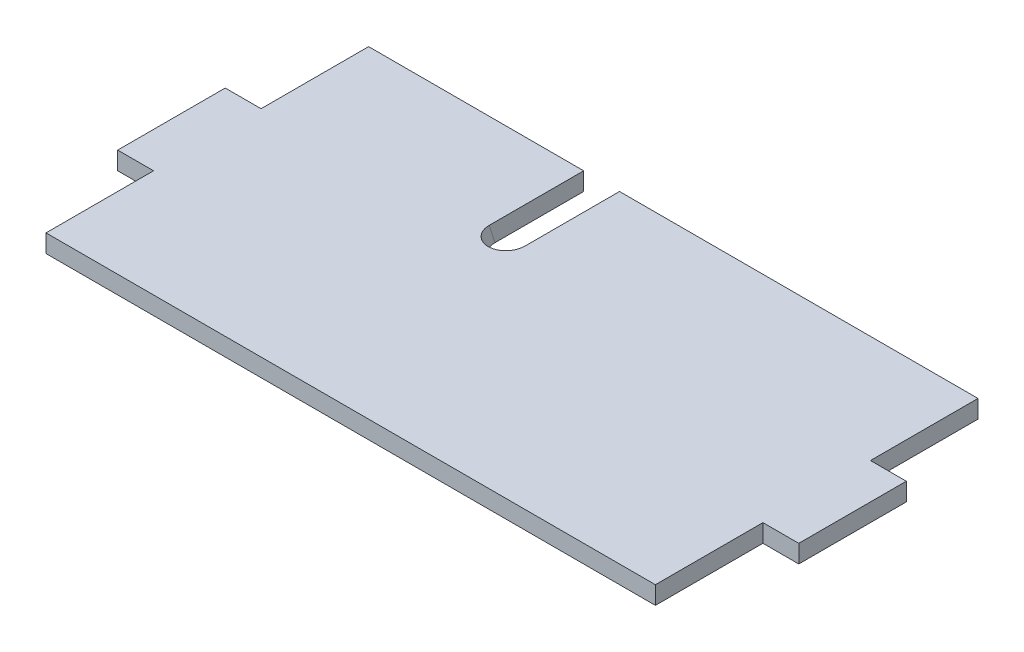
ISO-10303-21;
HEADER;
FILE_DESCRIPTION(('STEP AP214'),'2;1');
FILE_NAME('part.step','',(''),(''),'','','');
FILE_SCHEMA(('AUTOMOTIVE_DESIGN { 1 0 10303 214 1 1 1 1 }'));
ENDSEC;
DATA;
#1=APPLICATION_CONTEXT('core data for automotive mechanical design processes');
#2=APPLICATION_PROTOCOL_DEFINITION('international standard','automotive_design',2000,#1);
#3=PRODUCT_CONTEXT('',#1,'mechanical');
#4=PRODUCT('Part','Part','',(#3));
#5=PRODUCT_RELATED_PRODUCT_CATEGORY('part','',(#4));
#6=PRODUCT_DEFINITION_FORMATION('','',#4);
#7=PRODUCT_DEFINITION_CONTEXT('part definition',#1,'design');
#8=PRODUCT_DEFINITION('design','',#6,#7);
#9=PRODUCT_DEFINITION_SHAPE('','',#8);
#10=(LENGTH_UNIT() NAMED_UNIT(*) SI_UNIT(.MILLI.,.METRE.));
#11=(NAMED_UNIT(*) PLANE_ANGLE_UNIT() SI_UNIT($,.RADIAN.));
#12=(NAMED_UNIT(*) SI_UNIT($,.STERADIAN.) SOLID_ANGLE_UNIT());
#13=UNCERTAINTY_MEASURE_WITH_UNIT(LENGTH_MEASURE(1.E-05),#10,'distance_accuracy_value','');
#14=(GEOMETRIC_REPRESENTATION_CONTEXT(3) GLOBAL_UNCERTAINTY_ASSIGNED_CONTEXT((#13)) GLOBAL_UNIT_ASSIGNED_CONTEXT((#10,
#11,#12)) REPRESENTATION_CONTEXT('',''));
#15=CARTESIAN_POINT('',(0.,0.,0.));
#16=DIRECTION('',(0.,0.,1.));
#17=DIRECTION('',(1.,0.,0.));
#18=AXIS2_PLACEMENT_3D('',#15,#16,#17);
#19=CARTESIAN_POINT('',(-215.9,6.35,-88.9));
#20=DIRECTION('',(0.,0.,1.));
#21=DIRECTION('',(1.,0.,0.));
#22=AXIS2_PLACEMENT_3D('',#19,#20,#21);
#23=PLANE('',#22);
#24=DIRECTION('',(-1.,0.,0.));
#25=VECTOR('',#24,1.);
#26=CARTESIAN_POINT('',(-215.9,6.35,-88.9));
#27=LINE('',#26,#25);
#28=CARTESIAN_POINT('',(-63.5000000000009,6.34999999999999,-88.9));
#29=VERTEX_POINT('',#28);
#30=CARTESIAN_POINT('',(-215.9,6.35,-88.9));
#31=VERTEX_POINT('',#30);
#32=EDGE_CURVE('E306',#29,#31,#27,.T.);
#33=ORIENTED_EDGE('',*,*,#32,.F.);
#34=DIRECTION('',(0.,1.,0.));
#35=VECTOR('',#34,1.);
#36=CARTESIAN_POINT('',(-63.5000000000009,6.34999999999999,-88.9));
#37=LINE('',#36,#35);
#38=CARTESIAN_POINT('',(-63.5000000000009,-6.34999999999999,-88.9));
#39=VERTEX_POINT('',#38);
#40=EDGE_CURVE('E194',#39,#29,#37,.T.);
#41=ORIENTED_EDGE('',*,*,#40,.F.);
#42=DIRECTION('',(-1.,0.,0.));
#43=VECTOR('',#42,1.);
#44=CARTESIAN_POINT('',(-215.9,-6.35,-88.9));
#45=LINE('',#44,#43);
#46=CARTESIAN_POINT('',(-215.9,-6.35,-88.9));
#47=VERTEX_POINT('',#46);
#48=EDGE_CURVE('E201',#39,#47,#45,.T.);
#49=ORIENTED_EDGE('',*,*,#48,.T.);
#50=DIRECTION('',(0.,-1.,0.));
#51=VECTOR('',#50,1.);
#52=CARTESIAN_POINT('',(-215.9,6.35,-88.9));
#53=LINE('',#52,#51);
#54=EDGE_CURVE('E274',#31,#47,#53,.T.);
#55=ORIENTED_EDGE('',*,*,#54,.F.);
#56=EDGE_LOOP('',(#33,#41,#49,#55));
#57=FACE_BOUND('',#56,.T.);
#58=ADVANCED_FACE('F43',(#57),#23,.F.);
#59=CARTESIAN_POINT('',(-50.7999999999984,-226.171808135511,-98.2610939856412));
#60=DIRECTION('',(0.,0.950122861158082,0.31187585463575));
#61=DIRECTION('',(0.,0.31187585463575,-0.950122861158083));
#62=AXIS2_PLACEMENT_3D('',#59,#60,#61);
#63=CYLINDRICAL_SURFACE('',#62,12.7000000000001);
#64=CARTESIAN_POINT('',(-50.7999999999983,-6.34999999999999,-26.1050422974673));
#65=DIRECTION('',(0.,1.,0.));
#66=DIRECTION('',(0.,0.,1.));
#67=AXIS2_PLACEMENT_3D('',#64,#65,#66);
#68=ELLIPSE('',#67,13.3666923712586,12.7000000000001);
#69=CARTESIAN_POINT('',(-38.0999999999989,-6.34999999999999,-26.1050422974674));
#70=VERTEX_POINT('',#69);
#71=CARTESIAN_POINT('',(-63.4999999999984,-6.34999999999999,-26.1050422974673));
#72=VERTEX_POINT('',#71);
#73=EDGE_CURVE('E11',#70,#72,#68,.F.);
#74=ORIENTED_EDGE('',*,*,#73,.T.);
#75=DIRECTION('',(0.,0.950122861158082,0.31187585463575));
#76=VECTOR('',#75,1.);
#77=CARTESIAN_POINT('',(-63.4999999999997,-226.171808135511,-98.2610939856412));
#78=LINE('',#77,#76);
#79=CARTESIAN_POINT('',(-63.4999999999996,6.34999999999999,-21.936293690528));
#80=VERTEX_POINT('',#79);
#81=EDGE_CURVE('E184',#80,#72,#78,.F.);
#82=ORIENTED_EDGE('',*,*,#81,.F.);
#83=CARTESIAN_POINT('',(-50.7999999999983,6.34999999999999,-21.936293690528));
#84=DIRECTION('',(0.,1.,0.));
#85=DIRECTION('',(0.,0.,1.));
#86=AXIS2_PLACEMENT_3D('',#83,#84,#85);
#87=ELLIPSE('',#86,13.3666923712586,12.7000000000001);
#88=CARTESIAN_POINT('',(-38.0999999999982,6.34999999999999,-21.936293690528));
#89=VERTEX_POINT('',#88);
#90=EDGE_CURVE('E47',#89,#80,#87,.F.);
#91=ORIENTED_EDGE('',*,*,#90,.F.);
#92=DIRECTION('',(0.,0.950122861158082,0.31187585463575));
#93=VECTOR('',#92,1.);
#94=CARTESIAN_POINT('',(-38.0999999999989,-226.171808135511,-98.2610939856412));
#95=LINE('',#94,#93);
#96=EDGE_CURVE('E203',#89,#70,#95,.F.);
#97=ORIENTED_EDGE('',*,*,#96,.T.);
#98=EDGE_LOOP('',(#74,#82,#91,#97));
#99=FACE_BOUND('',#98,.T.);
#100=ADVANCED_FACE('F205',(#99),#63,.F.);
#101=CARTESIAN_POINT('',(-215.9,6.35,-88.9));
#102=DIRECTION('',(1.,0.,0.));
#103=DIRECTION('',(0.,0.,-1.));
#104=AXIS2_PLACEMENT_3D('',#101,#102,#103);
#105=PLANE('',#104);
#106=DIRECTION('',(0.,0.,1.));
#107=VECTOR('',#106,1.);
#108=CARTESIAN_POINT('',(-215.9,-6.35,-88.9));
#109=LINE('',#108,#107);
#110=CARTESIAN_POINT('',(-215.9,-6.35,-12.7));
#111=VERTEX_POINT('',#110);
#112=EDGE_CURVE('E193',#47,#111,#109,.T.);
#113=ORIENTED_EDGE('',*,*,#112,.T.);
#114=DIRECTION('',(0.,-1.,0.));
#115=VECTOR('',#114,1.);
#116=CARTESIAN_POINT('',(-215.9,6.35,-12.7));
#117=LINE('',#116,#115);
#118=CARTESIAN_POINT('',(-215.9,6.35,-12.7));
#119=VERTEX_POINT('',#118);
#120=EDGE_CURVE('E220',#119,#111,#117,.T.);
#121=ORIENTED_EDGE('',*,*,#120,.F.);
#122=DIRECTION('',(0.,0.,1.));
#123=VECTOR('',#122,1.);
#124=CARTESIAN_POINT('',(-215.9,6.35,-88.9));
#125=LINE('',#124,#123);
#126=EDGE_CURVE('E336',#31,#119,#125,.T.);
#127=ORIENTED_EDGE('',*,*,#126,.F.);
#128=ORIENTED_EDGE('',*,*,#54,.T.);
#129=EDGE_LOOP('',(#113,#121,#127,#128));
#130=FACE_BOUND('',#129,.T.);
#131=ADVANCED_FACE('F357',(#130),#105,.F.);
#132=CARTESIAN_POINT('',(-241.3,6.35,-12.7));
#133=DIRECTION('',(0.,0.,1.));
#134=DIRECTION('',(1.,0.,0.));
#135=AXIS2_PLACEMENT_3D('',#132,#133,#134);
#136=PLANE('',#135);
#137=DIRECTION('',(-1.,0.,0.));
#138=VECTOR('',#137,1.);
#139=CARTESIAN_POINT('',(-241.3,-6.35,-12.7));
#140=LINE('',#139,#138);
#141=CARTESIAN_POINT('',(-241.3,-6.35,-12.7));
#142=VERTEX_POINT('',#141);
#143=EDGE_CURVE('E225',#111,#142,#140,.T.);
#144=ORIENTED_EDGE('',*,*,#143,.T.);
#145=DIRECTION('',(0.,-1.,0.));
#146=VECTOR('',#145,1.);
#147=CARTESIAN_POINT('',(-241.3,6.35,-12.7));
#148=LINE('',#147,#146);
#149=CARTESIAN_POINT('',(-241.3,6.35,-12.7));
#150=VERTEX_POINT('',#149);
#151=EDGE_CURVE('E226',#150,#142,#148,.T.);
#152=ORIENTED_EDGE('',*,*,#151,.F.);
#153=DIRECTION('',(-1.,0.,0.));
#154=VECTOR('',#153,1.);
#155=CARTESIAN_POINT('',(-241.3,6.35,-12.7));
#156=LINE('',#155,#154);
#157=EDGE_CURVE('E334',#119,#150,#156,.T.);
#158=ORIENTED_EDGE('',*,*,#157,.F.);
#159=ORIENTED_EDGE('',*,*,#120,.T.);
#160=EDGE_LOOP('',(#144,#152,#158,#159));
#161=FACE_BOUND('',#160,.T.);
#162=ADVANCED_FACE('F359',(#161),#136,.F.);
#163=CARTESIAN_POINT('',(-241.3,6.35,-12.7));
#164=DIRECTION('',(1.,0.,0.));
#165=DIRECTION('',(0.,0.,-1.));
#166=AXIS2_PLACEMENT_3D('',#163,#164,#165);
#167=PLANE('',#166);
#168=DIRECTION('',(0.,0.,1.));
#169=VECTOR('',#168,1.);
#170=CARTESIAN_POINT('',(-241.3,-6.35,-12.7));
#171=LINE('',#170,#169);
#172=CARTESIAN_POINT('',(-241.3,-6.35,63.5));
#173=VERTEX_POINT('',#172);
#174=EDGE_CURVE('E224',#142,#173,#171,.T.);
#175=ORIENTED_EDGE('',*,*,#174,.T.);
#176=DIRECTION('',(0.,-1.,0.));
#177=VECTOR('',#176,1.);
#178=CARTESIAN_POINT('',(-241.3,6.35,63.5));
#179=LINE('',#178,#177);
#180=CARTESIAN_POINT('',(-241.3,6.35,63.5));
#181=VERTEX_POINT('',#180);
#182=EDGE_CURVE('E230',#181,#173,#179,.T.);
#183=ORIENTED_EDGE('',*,*,#182,.F.);
#184=DIRECTION('',(0.,0.,1.));
#185=VECTOR('',#184,1.);
#186=CARTESIAN_POINT('',(-241.3,6.35,-12.7));
#187=LINE('',#186,#185);
#188=EDGE_CURVE('E331',#150,#181,#187,.T.);
#189=ORIENTED_EDGE('',*,*,#188,.F.);
#190=ORIENTED_EDGE('',*,*,#151,.T.);
#191=EDGE_LOOP('',(#175,#183,#189,#190));
#192=FACE_BOUND('',#191,.T.);
#193=ADVANCED_FACE('F366',(#192),#167,.F.);
#194=CARTESIAN_POINT('',(-215.9,6.35,63.5));
#195=DIRECTION('',(0.,0.,-1.));
#196=DIRECTION('',(-1.,0.,0.));
#197=AXIS2_PLACEMENT_3D('',#194,#195,#196);
#198=PLANE('',#197);
#199=DIRECTION('',(1.,0.,0.));
#200=VECTOR('',#199,1.);
#201=CARTESIAN_POINT('',(-215.9,-6.35,63.5));
#202=LINE('',#201,#200);
#203=CARTESIAN_POINT('',(-215.9,-6.35,63.5));
#204=VERTEX_POINT('',#203);
#205=EDGE_CURVE('E229',#173,#204,#202,.T.);
#206=ORIENTED_EDGE('',*,*,#205,.T.);
#207=DIRECTION('',(0.,-1.,0.));
#208=VECTOR('',#207,1.);
#209=CARTESIAN_POINT('',(-215.9,6.35,63.5));
#210=LINE('',#209,#208);
#211=CARTESIAN_POINT('',(-215.9,6.35,63.5));
#212=VERTEX_POINT('',#211);
#213=EDGE_CURVE('E235',#212,#204,#210,.T.);
#214=ORIENTED_EDGE('',*,*,#213,.F.);
#215=DIRECTION('',(1.,0.,0.));
#216=VECTOR('',#215,1.);
#217=CARTESIAN_POINT('',(-215.9,6.35,63.5));
#218=LINE('',#217,#216);
#219=EDGE_CURVE('E328',#181,#212,#218,.T.);
#220=ORIENTED_EDGE('',*,*,#219,.F.);
#221=ORIENTED_EDGE('',*,*,#182,.T.);
#222=EDGE_LOOP('',(#206,#214,#220,#221));
#223=FACE_BOUND('',#222,.T.);
#224=ADVANCED_FACE('F370',(#223),#198,.F.);
#225=CARTESIAN_POINT('',(-215.9,6.35,63.5));
#226=DIRECTION('',(1.,0.,0.));
#227=DIRECTION('',(0.,0.,-1.));
#228=AXIS2_PLACEMENT_3D('',#225,#226,#227);
#229=PLANE('',#228);
#230=DIRECTION('',(0.,0.,1.));
#231=VECTOR('',#230,1.);
#232=CARTESIAN_POINT('',(-215.9,-6.35,63.5));
#233=LINE('',#232,#231);
#234=CARTESIAN_POINT('',(-215.9,-6.35,139.7));
#235=VERTEX_POINT('',#234);
#236=EDGE_CURVE('E234',#204,#235,#233,.T.);
#237=ORIENTED_EDGE('',*,*,#236,.T.);
#238=DIRECTION('',(0.,-1.,0.));
#239=VECTOR('',#238,1.);
#240=CARTESIAN_POINT('',(-215.9,6.35,139.7));
#241=LINE('',#240,#239);
#242=CARTESIAN_POINT('',(-215.9,6.35,139.7));
#243=VERTEX_POINT('',#242);
#244=EDGE_CURVE('E240',#243,#235,#241,.T.);
#245=ORIENTED_EDGE('',*,*,#244,.F.);
#246=DIRECTION('',(0.,0.,1.));
#247=VECTOR('',#246,1.);
#248=CARTESIAN_POINT('',(-215.9,6.35,63.5));
#249=LINE('',#248,#247);
#250=EDGE_CURVE('E325',#212,#243,#249,.T.);
#251=ORIENTED_EDGE('',*,*,#250,.F.);
#252=ORIENTED_EDGE('',*,*,#213,.T.);
#253=EDGE_LOOP('',(#237,#245,#251,#252));
#254=FACE_BOUND('',#253,.T.);
#255=ADVANCED_FACE('F375',(#254),#229,.F.);
#256=CARTESIAN_POINT('',(-215.9,6.35,139.7));
#257=DIRECTION('',(0.,0.,-1.));
#258=DIRECTION('',(-1.,0.,0.));
#259=AXIS2_PLACEMENT_3D('',#256,#257,#258);
#260=PLANE('',#259);
#261=DIRECTION('',(1.,0.,0.));
#262=VECTOR('',#261,1.);
#263=CARTESIAN_POINT('',(-215.9,-6.35,139.7));
#264=LINE('',#263,#262);
#265=CARTESIAN_POINT('',(215.9,-6.35,139.7));
#266=VERTEX_POINT('',#265);
#267=EDGE_CURVE('E239',#235,#266,#264,.T.);
#268=ORIENTED_EDGE('',*,*,#267,.T.);
#269=DIRECTION('',(0.,-1.,0.));
#270=VECTOR('',#269,1.);
#271=CARTESIAN_POINT('',(215.9,6.35,139.7));
#272=LINE('',#271,#270);
#273=CARTESIAN_POINT('',(215.9,6.35,139.7));
#274=VERTEX_POINT('',#273);
#275=EDGE_CURVE('E245',#274,#266,#272,.T.);
#276=ORIENTED_EDGE('',*,*,#275,.F.);
#277=DIRECTION('',(1.,0.,0.));
#278=VECTOR('',#277,1.);
#279=CARTESIAN_POINT('',(-215.9,6.35,139.7));
#280=LINE('',#279,#278);
#281=EDGE_CURVE('E322',#243,#274,#280,.T.);
#282=ORIENTED_EDGE('',*,*,#281,.F.);
#283=ORIENTED_EDGE('',*,*,#244,.T.);
#284=EDGE_LOOP('',(#268,#276,#282,#283));
#285=FACE_BOUND('',#284,.T.);
#286=ADVANCED_FACE('F381',(#285),#260,.F.);
#287=CARTESIAN_POINT('',(215.9,6.35,63.5));
#288=DIRECTION('',(-1.,0.,0.));
#289=DIRECTION('',(0.,0.,1.));
#290=AXIS2_PLACEMENT_3D('',#287,#288,#289);
#291=PLANE('',#290);
#292=DIRECTION('',(0.,0.,-1.));
#293=VECTOR('',#292,1.);
#294=CARTESIAN_POINT('',(215.9,-6.35,63.5));
#295=LINE('',#294,#293);
#296=CARTESIAN_POINT('',(215.9,-6.35,63.5));
#297=VERTEX_POINT('',#296);
#298=EDGE_CURVE('E244',#266,#297,#295,.T.);
#299=ORIENTED_EDGE('',*,*,#298,.T.);
#300=DIRECTION('',(0.,-1.,0.));
#301=VECTOR('',#300,1.);
#302=CARTESIAN_POINT('',(215.9,6.35,63.5));
#303=LINE('',#302,#301);
#304=CARTESIAN_POINT('',(215.9,6.35,63.5));
#305=VERTEX_POINT('',#304);
#306=EDGE_CURVE('E250',#305,#297,#303,.T.);
#307=ORIENTED_EDGE('',*,*,#306,.F.);
#308=DIRECTION('',(0.,0.,-1.));
#309=VECTOR('',#308,1.);
#310=CARTESIAN_POINT('',(215.9,6.35,63.5));
#311=LINE('',#310,#309);
#312=EDGE_CURVE('E319',#274,#305,#311,.T.);
#313=ORIENTED_EDGE('',*,*,#312,.F.);
#314=ORIENTED_EDGE('',*,*,#275,.T.);
#315=EDGE_LOOP('',(#299,#307,#313,#314));
#316=FACE_BOUND('',#315,.T.);
#317=ADVANCED_FACE('F385',(#316),#291,.F.);
#318=CARTESIAN_POINT('',(215.9,6.35,63.5));
#319=DIRECTION('',(0.,0.,-1.));
#320=DIRECTION('',(-1.,0.,0.));
#321=AXIS2_PLACEMENT_3D('',#318,#319,#320);
#322=PLANE('',#321);
#323=DIRECTION('',(1.,0.,0.));
#324=VECTOR('',#323,1.);
#325=CARTESIAN_POINT('',(215.9,-6.35,63.5));
#326=LINE('',#325,#324);
#327=CARTESIAN_POINT('',(241.3,-6.35,63.5));
#328=VERTEX_POINT('',#327);
#329=EDGE_CURVE('E249',#297,#328,#326,.T.);
#330=ORIENTED_EDGE('',*,*,#329,.T.);
#331=DIRECTION('',(0.,-1.,0.));
#332=VECTOR('',#331,1.);
#333=CARTESIAN_POINT('',(241.3,6.35,63.5));
#334=LINE('',#333,#332);
#335=CARTESIAN_POINT('',(241.3,6.35,63.5));
#336=VERTEX_POINT('',#335);
#337=EDGE_CURVE('E255',#336,#328,#334,.T.);
#338=ORIENTED_EDGE('',*,*,#337,.F.);
#339=DIRECTION('',(1.,0.,0.));
#340=VECTOR('',#339,1.);
#341=CARTESIAN_POINT('',(215.9,6.35,63.5));
#342=LINE('',#341,#340);
#343=EDGE_CURVE('E316',#305,#336,#342,.T.);
#344=ORIENTED_EDGE('',*,*,#343,.F.);
#345=ORIENTED_EDGE('',*,*,#306,.T.);
#346=EDGE_LOOP('',(#330,#338,#344,#345));
#347=FACE_BOUND('',#346,.T.);
#348=ADVANCED_FACE('F390',(#347),#322,.F.);
#349=CARTESIAN_POINT('',(241.3,6.35,-12.7));
#350=DIRECTION('',(-1.,0.,0.));
#351=DIRECTION('',(0.,0.,1.));
#352=AXIS2_PLACEMENT_3D('',#349,#350,#351);
#353=PLANE('',#352);
#354=DIRECTION('',(0.,0.,-1.));
#355=VECTOR('',#354,1.);
#356=CARTESIAN_POINT('',(241.3,-6.35,-12.7));
#357=LINE('',#356,#355);
#358=CARTESIAN_POINT('',(241.3,-6.35,-12.7));
#359=VERTEX_POINT('',#358);
#360=EDGE_CURVE('E254',#328,#359,#357,.T.);
#361=ORIENTED_EDGE('',*,*,#360,.T.);
#362=DIRECTION('',(0.,-1.,0.));
#363=VECTOR('',#362,1.);
#364=CARTESIAN_POINT('',(241.3,6.35,-12.7));
#365=LINE('',#364,#363);
#366=CARTESIAN_POINT('',(241.3,6.35,-12.7));
#367=VERTEX_POINT('',#366);
#368=EDGE_CURVE('E260',#367,#359,#365,.T.);
#369=ORIENTED_EDGE('',*,*,#368,.F.);
#370=DIRECTION('',(0.,0.,-1.));
#371=VECTOR('',#370,1.);
#372=CARTESIAN_POINT('',(241.3,6.35,-12.7));
#373=LINE('',#372,#371);
#374=EDGE_CURVE('E313',#336,#367,#373,.T.);
#375=ORIENTED_EDGE('',*,*,#374,.F.);
#376=ORIENTED_EDGE('',*,*,#337,.T.);
#377=EDGE_LOOP('',(#361,#369,#375,#376));
#378=FACE_BOUND('',#377,.T.);
#379=ADVANCED_FACE('F396',(#378),#353,.F.);
#380=CARTESIAN_POINT('',(241.3,6.35,-12.7));
#381=DIRECTION('',(0.,0.,1.));
#382=DIRECTION('',(1.,0.,0.));
#383=AXIS2_PLACEMENT_3D('',#380,#381,#382);
#384=PLANE('',#383);
#385=DIRECTION('',(-1.,0.,0.));
#386=VECTOR('',#385,1.);
#387=CARTESIAN_POINT('',(241.3,-6.35,-12.7));
#388=LINE('',#387,#386);
#389=CARTESIAN_POINT('',(215.9,-6.35,-12.7));
#390=VERTEX_POINT('',#389);
#391=EDGE_CURVE('E259',#359,#390,#388,.T.);
#392=ORIENTED_EDGE('',*,*,#391,.T.);
#393=DIRECTION('',(0.,-1.,0.));
#394=VECTOR('',#393,1.);
#395=CARTESIAN_POINT('',(215.9,6.35,-12.7));
#396=LINE('',#395,#394);
#397=CARTESIAN_POINT('',(215.9,6.35,-12.7));
#398=VERTEX_POINT('',#397);
#399=EDGE_CURVE('E265',#398,#390,#396,.T.);
#400=ORIENTED_EDGE('',*,*,#399,.F.);
#401=DIRECTION('',(-1.,0.,0.));
#402=VECTOR('',#401,1.);
#403=CARTESIAN_POINT('',(241.3,6.35,-12.7));
#404=LINE('',#403,#402);
#405=EDGE_CURVE('E310',#367,#398,#404,.T.);
#406=ORIENTED_EDGE('',*,*,#405,.F.);
#407=ORIENTED_EDGE('',*,*,#368,.T.);
#408=EDGE_LOOP('',(#392,#400,#406,#407));
#409=FACE_BOUND('',#408,.T.);
#410=ADVANCED_FACE('F400',(#409),#384,.F.);
#411=CARTESIAN_POINT('',(215.9,6.35,-88.9));
#412=DIRECTION('',(-1.,0.,0.));
#413=DIRECTION('',(0.,0.,1.));
#414=AXIS2_PLACEMENT_3D('',#411,#412,#413);
#415=PLANE('',#414);
#416=DIRECTION('',(0.,0.,-1.));
#417=VECTOR('',#416,1.);
#418=CARTESIAN_POINT('',(215.9,-6.35,-88.9));
#419=LINE('',#418,#417);
#420=CARTESIAN_POINT('',(215.9,-6.35,-88.9));
#421=VERTEX_POINT('',#420);
#422=EDGE_CURVE('E264',#390,#421,#419,.T.);
#423=ORIENTED_EDGE('',*,*,#422,.T.);
#424=DIRECTION('',(0.,-1.,0.));
#425=VECTOR('',#424,1.);
#426=CARTESIAN_POINT('',(215.9,6.35,-88.9));
#427=LINE('',#426,#425);
#428=CARTESIAN_POINT('',(215.9,6.35,-88.9));
#429=VERTEX_POINT('',#428);
#430=EDGE_CURVE('E269',#429,#421,#427,.T.);
#431=ORIENTED_EDGE('',*,*,#430,.F.);
#432=DIRECTION('',(0.,0.,-1.));
#433=VECTOR('',#432,1.);
#434=CARTESIAN_POINT('',(215.9,6.35,-88.9));
#435=LINE('',#434,#433);
#436=EDGE_CURVE('E307',#398,#429,#435,.T.);
#437=ORIENTED_EDGE('',*,*,#436,.F.);
#438=ORIENTED_EDGE('',*,*,#399,.T.);
#439=EDGE_LOOP('',(#423,#431,#437,#438));
#440=FACE_BOUND('',#439,.T.);
#441=ADVANCED_FACE('F405',(#440),#415,.F.);
#442=CARTESIAN_POINT('',(-38.1000000000006,-6.35,-88.9));
#443=VERTEX_POINT('',#442);
#444=EDGE_CURVE('E273',#421,#443,#45,.T.);
#445=ORIENTED_EDGE('',*,*,#444,.T.);
#446=DIRECTION('',(0.,-1.,0.));
#447=VECTOR('',#446,1.);
#448=CARTESIAN_POINT('',(-38.1000000000006,-6.35,-88.9));
#449=LINE('',#448,#447);
#450=CARTESIAN_POINT('',(-38.1000000000007,6.34999999999999,-88.9));
#451=VERTEX_POINT('',#450);
#452=EDGE_CURVE('E211',#451,#443,#449,.T.);
#453=ORIENTED_EDGE('',*,*,#452,.F.);
#454=EDGE_CURVE('E53',#429,#451,#27,.T.);
#455=ORIENTED_EDGE('',*,*,#454,.F.);
#456=ORIENTED_EDGE('',*,*,#430,.T.);
#457=EDGE_LOOP('',(#445,#453,#455,#456));
#458=FACE_BOUND('',#457,.T.);
#459=ADVANCED_FACE('F347',(#458),#23,.F.);
#460=CARTESIAN_POINT('',(0.,6.35,0.));
#461=DIRECTION('',(0.,1.,0.));
#462=DIRECTION('',(0.,0.,1.));
#463=AXIS2_PLACEMENT_3D('',#460,#461,#462);
#464=PLANE('',#463);
#465=DIRECTION('',(0.,0.,-1.));
#466=VECTOR('',#465,1.);
#467=CARTESIAN_POINT('',(-63.5000000000009,6.34999999999999,139.701));
#468=LINE('',#467,#466);
#469=EDGE_CURVE('E75',#80,#29,#468,.T.);
#470=ORIENTED_EDGE('',*,*,#469,.T.);
#471=ORIENTED_EDGE('',*,*,#32,.T.);
#472=ORIENTED_EDGE('',*,*,#126,.T.);
#473=ORIENTED_EDGE('',*,*,#157,.T.);
#474=ORIENTED_EDGE('',*,*,#188,.T.);
#475=ORIENTED_EDGE('',*,*,#219,.T.);
#476=ORIENTED_EDGE('',*,*,#250,.T.);
#477=ORIENTED_EDGE('',*,*,#281,.T.);
#478=ORIENTED_EDGE('',*,*,#312,.T.);
#479=ORIENTED_EDGE('',*,*,#343,.T.);
#480=ORIENTED_EDGE('',*,*,#374,.T.);
#481=ORIENTED_EDGE('',*,*,#405,.T.);
#482=ORIENTED_EDGE('',*,*,#436,.T.);
#483=ORIENTED_EDGE('',*,*,#454,.T.);
#484=DIRECTION('',(0.,0.,-1.));
#485=VECTOR('',#484,1.);
#486=CARTESIAN_POINT('',(-38.1000000000007,6.34999999999999,139.701));
#487=LINE('',#486,#485);
#488=EDGE_CURVE('E215',#89,#451,#487,.T.);
#489=ORIENTED_EDGE('',*,*,#488,.F.);
#490=ORIENTED_EDGE('',*,*,#90,.T.);
#491=EDGE_LOOP('',(#470,#471,#472,#473,#474,#475,#476,#477,#478,#479,#480,#481,#482,#483,#489,#490));
#492=FACE_BOUND('',#491,.T.);
#493=ADVANCED_FACE('F45',(#492),#464,.T.);
#494=CARTESIAN_POINT('',(0.,-6.35,0.));
#495=DIRECTION('',(0.,1.,0.));
#496=DIRECTION('',(0.,0.,1.));
#497=AXIS2_PLACEMENT_3D('',#494,#495,#496);
#498=PLANE('',#497);
#499=ORIENTED_EDGE('',*,*,#48,.F.);
#500=DIRECTION('',(0.,0.,-1.));
#501=VECTOR('',#500,1.);
#502=CARTESIAN_POINT('',(-63.5000000000009,-6.34999999999999,139.701));
#503=LINE('',#502,#501);
#504=EDGE_CURVE('E187',#72,#39,#503,.T.);
#505=ORIENTED_EDGE('',*,*,#504,.F.);
#506=ORIENTED_EDGE('',*,*,#73,.F.);
#507=DIRECTION('',(0.,0.,-1.));
#508=VECTOR('',#507,1.);
#509=CARTESIAN_POINT('',(-38.1000000000006,-6.35,139.701));
#510=LINE('',#509,#508);
#511=EDGE_CURVE('E64',#70,#443,#510,.T.);
#512=ORIENTED_EDGE('',*,*,#511,.T.);
#513=ORIENTED_EDGE('',*,*,#444,.F.);
#514=ORIENTED_EDGE('',*,*,#422,.F.);
#515=ORIENTED_EDGE('',*,*,#391,.F.);
#516=ORIENTED_EDGE('',*,*,#360,.F.);
#517=ORIENTED_EDGE('',*,*,#329,.F.);
#518=ORIENTED_EDGE('',*,*,#298,.F.);
#519=ORIENTED_EDGE('',*,*,#267,.F.);
#520=ORIENTED_EDGE('',*,*,#236,.F.);
#521=ORIENTED_EDGE('',*,*,#205,.F.);
#522=ORIENTED_EDGE('',*,*,#174,.F.);
#523=ORIENTED_EDGE('',*,*,#143,.F.);
#524=ORIENTED_EDGE('',*,*,#112,.F.);
#525=EDGE_LOOP('',(#499,#505,#506,#512,#513,#514,#515,#516,#517,#518,#519,#520,#521,#522,#523,#524));
#526=FACE_BOUND('',#525,.T.);
#527=ADVANCED_FACE('F199',(#526),#498,.F.);
#528=CARTESIAN_POINT('',(-38.1000000000006,-6.35,139.701));
#529=DIRECTION('',(1.,0.,0.));
#530=DIRECTION('',(0.,1.,0.));
#531=AXIS2_PLACEMENT_3D('',#528,#529,#530);
#532=PLANE('',#531);
#533=ORIENTED_EDGE('',*,*,#488,.T.);
#534=ORIENTED_EDGE('',*,*,#452,.T.);
#535=ORIENTED_EDGE('',*,*,#511,.F.);
#536=ORIENTED_EDGE('',*,*,#96,.F.);
#537=EDGE_LOOP('',(#533,#534,#535,#536));
#538=FACE_BOUND('',#537,.T.);
#539=ADVANCED_FACE('F345',(#538),#532,.F.);
#540=CARTESIAN_POINT('',(-63.5000000000009,6.34999999999999,139.701));
#541=DIRECTION('',(-1.,0.,0.));
#542=DIRECTION('',(0.,0.,1.));
#543=AXIS2_PLACEMENT_3D('',#540,#541,#542);
#544=PLANE('',#543);
#545=ORIENTED_EDGE('',*,*,#81,.T.);
#546=ORIENTED_EDGE('',*,*,#504,.T.);
#547=ORIENTED_EDGE('',*,*,#40,.T.);
#548=ORIENTED_EDGE('',*,*,#469,.F.);
#549=EDGE_LOOP('',(#545,#546,#547,#548));
#550=FACE_BOUND('',#549,.T.);
#551=ADVANCED_FACE('F186',(#550),#544,.F.);
#552=CLOSED_SHELL('',(#58,#100,#131,#162,#193,#224,#255,#286,#317,#348,#379,#410,#441,#459,#493,
#527,#539,#551));
#553=MANIFOLD_SOLID_BREP('B2',#552);
#554=ADVANCED_BREP_SHAPE_REPRESENTATION('',(#18,#553),#14);
#555=SHAPE_DEFINITION_REPRESENTATION(#9,#554);
ENDSEC;
END-ISO-10303-21;
